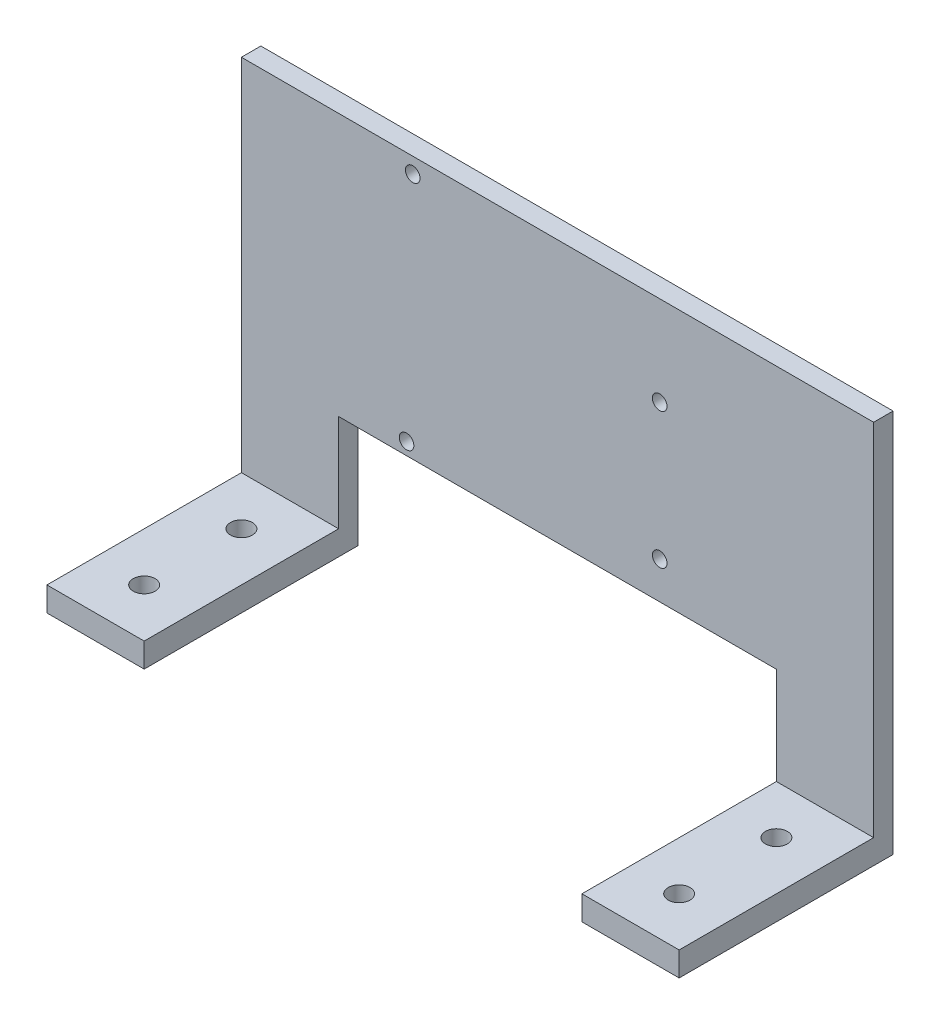
ISO-10303-21;
HEADER;
FILE_DESCRIPTION(('STEP AP214'),'2;1');
FILE_NAME('part.step','',(''),(''),'','','');
FILE_SCHEMA(('AUTOMOTIVE_DESIGN { 1 0 10303 214 1 1 1 1 }'));
ENDSEC;
DATA;
#1=APPLICATION_CONTEXT('core data for automotive mechanical design processes');
#2=APPLICATION_PROTOCOL_DEFINITION('international standard','automotive_design',2000,#1);
#3=PRODUCT_CONTEXT('',#1,'mechanical');
#4=PRODUCT('Part','Part','',(#3));
#5=PRODUCT_RELATED_PRODUCT_CATEGORY('part','',(#4));
#6=PRODUCT_DEFINITION_FORMATION('','',#4);
#7=PRODUCT_DEFINITION_CONTEXT('part definition',#1,'design');
#8=PRODUCT_DEFINITION('design','',#6,#7);
#9=PRODUCT_DEFINITION_SHAPE('','',#8);
#10=(LENGTH_UNIT() NAMED_UNIT(*) SI_UNIT(.MILLI.,.METRE.));
#11=(NAMED_UNIT(*) PLANE_ANGLE_UNIT() SI_UNIT($,.RADIAN.));
#12=(NAMED_UNIT(*) SI_UNIT($,.STERADIAN.) SOLID_ANGLE_UNIT());
#13=UNCERTAINTY_MEASURE_WITH_UNIT(LENGTH_MEASURE(1.E-05),#10,'distance_accuracy_value','');
#14=(GEOMETRIC_REPRESENTATION_CONTEXT(3) GLOBAL_UNCERTAINTY_ASSIGNED_CONTEXT((#13)) GLOBAL_UNIT_ASSIGNED_CONTEXT((#10,
#11,#12)) REPRESENTATION_CONTEXT('',''));
#15=CARTESIAN_POINT('',(0.,0.,0.));
#16=DIRECTION('',(0.,0.,1.));
#17=DIRECTION('',(1.,0.,0.));
#18=AXIS2_PLACEMENT_3D('',#15,#16,#17);
#19=CARTESIAN_POINT('',(0.,0.,0.));
#20=DIRECTION('',(0.,1.,0.));
#21=DIRECTION('',(0.,0.,1.));
#22=AXIS2_PLACEMENT_3D('',#19,#20,#21);
#23=PLANE('',#22);
#24=CARTESIAN_POINT('',(0.,0.,-20.));
#25=DIRECTION('',(0.,1.,0.));
#26=DIRECTION('',(0.,0.,1.));
#27=AXIS2_PLACEMENT_3D('',#24,#25,#26);
#28=CIRCLE('',#27,2.25);
#29=CARTESIAN_POINT('',(0.,0.,-17.75));
#30=VERTEX_POINT('',#29);
#31=EDGE_CURVE('E185',#30,#30,#28,.T.);
#32=ORIENTED_EDGE('',*,*,#31,.T.);
#33=EDGE_LOOP('',(#32));
#34=FACE_BOUND('',#33,.T.);
#35=CARTESIAN_POINT('',(0.,0.,0.));
#36=DIRECTION('',(0.,1.,0.));
#37=DIRECTION('',(0.,0.,1.));
#38=AXIS2_PLACEMENT_3D('',#35,#36,#37);
#39=CIRCLE('',#38,2.25);
#40=CARTESIAN_POINT('',(0.,0.,2.25));
#41=VERTEX_POINT('',#40);
#42=EDGE_CURVE('E179',#41,#41,#39,.T.);
#43=ORIENTED_EDGE('',*,*,#42,.T.);
#44=EDGE_LOOP('',(#43));
#45=FACE_BOUND('',#44,.T.);
#46=DIRECTION('',(-1.,0.,0.));
#47=VECTOR('',#46,1.);
#48=CARTESIAN_POINT('',(100.04,0.,-34.));
#49=LINE('',#48,#47);
#50=CARTESIAN_POINT('',(10.,0.,-34.));
#51=VERTEX_POINT('',#50);
#52=CARTESIAN_POINT('',(-10.,0.,-34.));
#53=VERTEX_POINT('',#52);
#54=EDGE_CURVE('E82',#51,#53,#49,.T.);
#55=ORIENTED_EDGE('',*,*,#54,.F.);
#56=DIRECTION('',(0.,0.,-1.));
#57=VECTOR('',#56,1.);
#58=CARTESIAN_POINT('',(10.,0.,-34.));
#59=LINE('',#58,#57);
#60=CARTESIAN_POINT('',(10.,0.,9.99999999999999));
#61=VERTEX_POINT('',#60);
#62=EDGE_CURVE('E164',#61,#51,#59,.T.);
#63=ORIENTED_EDGE('',*,*,#62,.F.);
#64=DIRECTION('',(1.,0.,0.));
#65=VECTOR('',#64,1.);
#66=CARTESIAN_POINT('',(-10.,0.,9.99999999999999));
#67=LINE('',#66,#65);
#68=CARTESIAN_POINT('',(-10.,0.,9.99999999999999));
#69=VERTEX_POINT('',#68);
#70=EDGE_CURVE('E168',#69,#61,#67,.T.);
#71=ORIENTED_EDGE('',*,*,#70,.F.);
#72=DIRECTION('',(0.,0.,1.));
#73=VECTOR('',#72,1.);
#74=CARTESIAN_POINT('',(-10.,0.,-34.));
#75=LINE('',#74,#73);
#76=EDGE_CURVE('E142',#53,#69,#75,.T.);
#77=ORIENTED_EDGE('',*,*,#76,.F.);
#78=EDGE_LOOP('',(#55,#63,#71,#77));
#79=FACE_BOUND('',#78,.T.);
#80=ADVANCED_FACE('F32',(#34,#45,#79),#23,.F.);
#81=CARTESIAN_POINT('',(0.,5.,0.));
#82=DIRECTION('',(0.,1.,0.));
#83=DIRECTION('',(0.,0.,1.));
#84=AXIS2_PLACEMENT_3D('',#81,#82,#83);
#85=PLANE('',#84);
#86=DIRECTION('',(1.,0.,0.));
#87=VECTOR('',#86,1.);
#88=CARTESIAN_POINT('',(0.,5.,-30.));
#89=LINE('',#88,#87);
#90=CARTESIAN_POINT('',(100.04,5.,-30.));
#91=VERTEX_POINT('',#90);
#92=CARTESIAN_POINT('',(120.04,5.,-30.));
#93=VERTEX_POINT('',#92);
#94=EDGE_CURVE('E133',#91,#93,#89,.T.);
#95=ORIENTED_EDGE('',*,*,#94,.F.);
#96=DIRECTION('',(0.,0.,1.));
#97=VECTOR('',#96,1.);
#98=CARTESIAN_POINT('',(100.04,5.,-34.));
#99=LINE('',#98,#97);
#100=CARTESIAN_POINT('',(100.04,5.,9.99999999999999));
#101=VERTEX_POINT('',#100);
#102=EDGE_CURVE('E102',#91,#101,#99,.T.);
#103=ORIENTED_EDGE('',*,*,#102,.T.);
#104=DIRECTION('',(1.,0.,0.));
#105=VECTOR('',#104,1.);
#106=CARTESIAN_POINT('',(100.04,5.,9.99999999999999));
#107=LINE('',#106,#105);
#108=CARTESIAN_POINT('',(120.04,5.,9.99999999999999));
#109=VERTEX_POINT('',#108);
#110=EDGE_CURVE('E54',#101,#109,#107,.T.);
#111=ORIENTED_EDGE('',*,*,#110,.T.);
#112=DIRECTION('',(0.,0.,-1.));
#113=VECTOR('',#112,1.);
#114=CARTESIAN_POINT('',(120.04,5.,-34.));
#115=LINE('',#114,#113);
#116=EDGE_CURVE('E48',#109,#93,#115,.T.);
#117=ORIENTED_EDGE('',*,*,#116,.T.);
#118=EDGE_LOOP('',(#95,#103,#111,#117));
#119=FACE_BOUND('',#118,.T.);
#120=CARTESIAN_POINT('',(110.04,5.,-20.));
#121=DIRECTION('',(0.,1.,0.));
#122=DIRECTION('',(0.,0.,1.));
#123=AXIS2_PLACEMENT_3D('',#120,#121,#122);
#124=CIRCLE('',#123,2.25);
#125=CARTESIAN_POINT('',(110.04,5.,-17.75));
#126=VERTEX_POINT('',#125);
#127=EDGE_CURVE('E119',#126,#126,#124,.T.);
#128=ORIENTED_EDGE('',*,*,#127,.F.);
#129=EDGE_LOOP('',(#128));
#130=FACE_BOUND('',#129,.T.);
#131=CARTESIAN_POINT('',(110.04,5.,0.));
#132=DIRECTION('',(0.,1.,0.));
#133=DIRECTION('',(0.,0.,1.));
#134=AXIS2_PLACEMENT_3D('',#131,#132,#133);
#135=CIRCLE('',#134,2.25);
#136=CARTESIAN_POINT('',(110.04,5.,2.25));
#137=VERTEX_POINT('',#136);
#138=EDGE_CURVE('E127',#137,#137,#135,.T.);
#139=ORIENTED_EDGE('',*,*,#138,.F.);
#140=EDGE_LOOP('',(#139));
#141=FACE_BOUND('',#140,.T.);
#142=ADVANCED_FACE('F311',(#119,#130,#141),#85,.T.);
#143=DIRECTION('',(0.,0.,1.));
#144=VECTOR('',#143,1.);
#145=CARTESIAN_POINT('',(100.04,0.,-34.));
#146=LINE('',#145,#144);
#147=CARTESIAN_POINT('',(100.04,0.,-34.));
#148=VERTEX_POINT('',#147);
#149=CARTESIAN_POINT('',(100.04,0.,9.99999999999999));
#150=VERTEX_POINT('',#149);
#151=EDGE_CURVE('E100',#148,#150,#146,.T.);
#152=ORIENTED_EDGE('',*,*,#151,.F.);
#153=CARTESIAN_POINT('',(120.04,0.,-34.));
#154=VERTEX_POINT('',#153);
#155=EDGE_CURVE('E92',#154,#148,#49,.T.);
#156=ORIENTED_EDGE('',*,*,#155,.F.);
#157=DIRECTION('',(0.,0.,-1.));
#158=VECTOR('',#157,1.);
#159=CARTESIAN_POINT('',(120.04,0.,-34.));
#160=LINE('',#159,#158);
#161=CARTESIAN_POINT('',(120.04,0.,9.99999999999999));
#162=VERTEX_POINT('',#161);
#163=EDGE_CURVE('E71',#162,#154,#160,.T.);
#164=ORIENTED_EDGE('',*,*,#163,.F.);
#165=DIRECTION('',(1.,0.,0.));
#166=VECTOR('',#165,1.);
#167=CARTESIAN_POINT('',(100.04,0.,9.99999999999999));
#168=LINE('',#167,#166);
#169=EDGE_CURVE('E83',#150,#162,#168,.T.);
#170=ORIENTED_EDGE('',*,*,#169,.F.);
#171=EDGE_LOOP('',(#152,#156,#164,#170));
#172=FACE_BOUND('',#171,.T.);
#173=CARTESIAN_POINT('',(110.04,0.,0.));
#174=DIRECTION('',(0.,1.,0.));
#175=DIRECTION('',(0.,0.,1.));
#176=AXIS2_PLACEMENT_3D('',#173,#174,#175);
#177=CIRCLE('',#176,2.25);
#178=CARTESIAN_POINT('',(110.04,0.,2.25));
#179=VERTEX_POINT('',#178);
#180=EDGE_CURVE('E130',#179,#179,#177,.T.);
#181=ORIENTED_EDGE('',*,*,#180,.T.);
#182=EDGE_LOOP('',(#181));
#183=FACE_BOUND('',#182,.T.);
#184=CARTESIAN_POINT('',(110.04,0.,-20.));
#185=DIRECTION('',(0.,1.,0.));
#186=DIRECTION('',(0.,0.,1.));
#187=AXIS2_PLACEMENT_3D('',#184,#185,#186);
#188=CIRCLE('',#187,2.25);
#189=CARTESIAN_POINT('',(110.04,0.,-17.75));
#190=VERTEX_POINT('',#189);
#191=EDGE_CURVE('E124',#190,#190,#188,.T.);
#192=ORIENTED_EDGE('',*,*,#191,.T.);
#193=EDGE_LOOP('',(#192));
#194=FACE_BOUND('',#193,.T.);
#195=ADVANCED_FACE('F98',(#172,#183,#194),#23,.F.);
#196=CARTESIAN_POINT('',(100.04,5.,-34.));
#197=DIRECTION('',(1.,0.,0.));
#198=DIRECTION('',(0.,0.,-1.));
#199=AXIS2_PLACEMENT_3D('',#196,#197,#198);
#200=PLANE('',#199);
#201=ORIENTED_EDGE('',*,*,#102,.F.);
#202=DIRECTION('',(0.,1.,0.));
#203=VECTOR('',#202,1.);
#204=CARTESIAN_POINT('',(100.04,0.,-30.));
#205=LINE('',#204,#203);
#206=CARTESIAN_POINT('',(100.04,25.,-30.));
#207=VERTEX_POINT('',#206);
#208=EDGE_CURVE('E205',#91,#207,#205,.T.);
#209=ORIENTED_EDGE('',*,*,#208,.T.);
#210=DIRECTION('',(0.,0.,1.));
#211=VECTOR('',#210,1.);
#212=CARTESIAN_POINT('',(100.04,25.,-35.));
#213=LINE('',#212,#211);
#214=CARTESIAN_POINT('',(100.04,25.,-34.));
#215=VERTEX_POINT('',#214);
#216=EDGE_CURVE('E197',#215,#207,#213,.T.);
#217=ORIENTED_EDGE('',*,*,#216,.F.);
#218=DIRECTION('',(0.,1.,0.));
#219=VECTOR('',#218,1.);
#220=CARTESIAN_POINT('',(100.04,5.,-34.));
#221=LINE('',#220,#219);
#222=EDGE_CURVE('E118',#148,#215,#221,.T.);
#223=ORIENTED_EDGE('',*,*,#222,.F.);
#224=ORIENTED_EDGE('',*,*,#151,.T.);
#225=DIRECTION('',(0.,-1.,0.));
#226=VECTOR('',#225,1.);
#227=CARTESIAN_POINT('',(100.04,5.,9.99999999999999));
#228=LINE('',#227,#226);
#229=EDGE_CURVE('E41',#101,#150,#228,.T.);
#230=ORIENTED_EDGE('',*,*,#229,.F.);
#231=EDGE_LOOP('',(#201,#209,#217,#223,#224,#230));
#232=FACE_BOUND('',#231,.T.);
#233=ADVANCED_FACE('F34',(#232),#200,.F.);
#234=CARTESIAN_POINT('',(100.04,5.,9.99999999999999));
#235=DIRECTION('',(0.,0.,-1.));
#236=DIRECTION('',(-1.,0.,0.));
#237=AXIS2_PLACEMENT_3D('',#234,#235,#236);
#238=PLANE('',#237);
#239=ORIENTED_EDGE('',*,*,#169,.T.);
#240=DIRECTION('',(0.,-1.,0.));
#241=VECTOR('',#240,1.);
#242=CARTESIAN_POINT('',(120.04,5.,9.99999999999999));
#243=LINE('',#242,#241);
#244=EDGE_CURVE('E78',#109,#162,#243,.T.);
#245=ORIENTED_EDGE('',*,*,#244,.F.);
#246=ORIENTED_EDGE('',*,*,#110,.F.);
#247=ORIENTED_EDGE('',*,*,#229,.T.);
#248=EDGE_LOOP('',(#239,#245,#246,#247));
#249=FACE_BOUND('',#248,.T.);
#250=ADVANCED_FACE('F112',(#249),#238,.F.);
#251=CARTESIAN_POINT('',(120.04,5.,-34.));
#252=DIRECTION('',(-1.,0.,0.));
#253=DIRECTION('',(0.,0.,1.));
#254=AXIS2_PLACEMENT_3D('',#251,#252,#253);
#255=PLANE('',#254);
#256=ORIENTED_EDGE('',*,*,#163,.T.);
#257=DIRECTION('',(0.,-1.,0.));
#258=VECTOR('',#257,1.);
#259=CARTESIAN_POINT('',(120.04,5.,-34.));
#260=LINE('',#259,#258);
#261=CARTESIAN_POINT('',(120.04,79.,-34.));
#262=VERTEX_POINT('',#261);
#263=EDGE_CURVE('E76',#262,#154,#260,.T.);
#264=ORIENTED_EDGE('',*,*,#263,.F.);
#265=DIRECTION('',(0.,0.,-1.));
#266=VECTOR('',#265,1.);
#267=CARTESIAN_POINT('',(120.04,79.,-34.));
#268=LINE('',#267,#266);
#269=CARTESIAN_POINT('',(120.04,79.,-30.));
#270=VERTEX_POINT('',#269);
#271=EDGE_CURVE('E149',#270,#262,#268,.T.);
#272=ORIENTED_EDGE('',*,*,#271,.F.);
#273=DIRECTION('',(0.,1.,0.));
#274=VECTOR('',#273,1.);
#275=CARTESIAN_POINT('',(120.04,0.,-30.));
#276=LINE('',#275,#274);
#277=EDGE_CURVE('E141',#93,#270,#276,.T.);
#278=ORIENTED_EDGE('',*,*,#277,.F.);
#279=ORIENTED_EDGE('',*,*,#116,.F.);
#280=ORIENTED_EDGE('',*,*,#244,.T.);
#281=EDGE_LOOP('',(#256,#264,#272,#278,#279,#280));
#282=FACE_BOUND('',#281,.T.);
#283=ADVANCED_FACE('F73',(#282),#255,.F.);
#284=CARTESIAN_POINT('',(100.04,5.,-34.));
#285=DIRECTION('',(0.,0.,1.));
#286=DIRECTION('',(1.,0.,0.));
#287=AXIS2_PLACEMENT_3D('',#284,#285,#286);
#288=PLANE('',#287);
#289=CARTESIAN_POINT('',(25.24,75.8,-34.));
#290=DIRECTION('',(0.,0.,1.));
#291=DIRECTION('',(1.,0.,0.));
#292=AXIS2_PLACEMENT_3D('',#289,#290,#291);
#293=CIRCLE('',#292,1.5);
#294=CARTESIAN_POINT('',(26.74,75.8,-34.));
#295=VERTEX_POINT('',#294);
#296=EDGE_CURVE('E225',#295,#295,#293,.T.);
#297=ORIENTED_EDGE('',*,*,#296,.T.);
#298=EDGE_LOOP('',(#297));
#299=FACE_BOUND('',#298,.T.);
#300=CARTESIAN_POINT('',(76.04,60.5599999999999,-34.));
#301=DIRECTION('',(0.,0.,1.));
#302=DIRECTION('',(1.,0.,0.));
#303=AXIS2_PLACEMENT_3D('',#300,#301,#302);
#304=CIRCLE('',#303,1.5);
#305=CARTESIAN_POINT('',(77.54,60.5599999999999,-34.));
#306=VERTEX_POINT('',#305);
#307=EDGE_CURVE('E219',#306,#306,#304,.T.);
#308=ORIENTED_EDGE('',*,*,#307,.T.);
#309=EDGE_LOOP('',(#308));
#310=FACE_BOUND('',#309,.T.);
#311=CARTESIAN_POINT('',(76.04,32.6199999999999,-34.));
#312=DIRECTION('',(0.,0.,1.));
#313=DIRECTION('',(1.,0.,0.));
#314=AXIS2_PLACEMENT_3D('',#311,#312,#313);
#315=CIRCLE('',#314,1.5);
#316=CARTESIAN_POINT('',(77.54,32.6199999999999,-34.));
#317=VERTEX_POINT('',#316);
#318=EDGE_CURVE('E213',#317,#317,#315,.T.);
#319=ORIENTED_EDGE('',*,*,#318,.T.);
#320=EDGE_LOOP('',(#319));
#321=FACE_BOUND('',#320,.T.);
#322=CARTESIAN_POINT('',(23.97,27.54,-34.));
#323=DIRECTION('',(0.,0.,1.));
#324=DIRECTION('',(1.,0.,0.));
#325=AXIS2_PLACEMENT_3D('',#322,#323,#324);
#326=CIRCLE('',#325,1.5);
#327=CARTESIAN_POINT('',(25.47,27.54,-34.));
#328=VERTEX_POINT('',#327);
#329=EDGE_CURVE('E36',#328,#328,#326,.T.);
#330=ORIENTED_EDGE('',*,*,#329,.T.);
#331=EDGE_LOOP('',(#330));
#332=FACE_BOUND('',#331,.T.);
#333=DIRECTION('',(-1.,0.,0.));
#334=VECTOR('',#333,1.);
#335=CARTESIAN_POINT('',(100.04,25.,-34.));
#336=LINE('',#335,#334);
#337=CARTESIAN_POINT('',(10.,25.,-34.));
#338=VERTEX_POINT('',#337);
#339=EDGE_CURVE('E193',#215,#338,#336,.T.);
#340=ORIENTED_EDGE('',*,*,#339,.T.);
#341=DIRECTION('',(0.,-1.,0.));
#342=VECTOR('',#341,1.);
#343=CARTESIAN_POINT('',(9.99999999999999,5.,-34.));
#344=LINE('',#343,#342);
#345=EDGE_CURVE('E188',#338,#51,#344,.T.);
#346=ORIENTED_EDGE('',*,*,#345,.T.);
#347=ORIENTED_EDGE('',*,*,#54,.T.);
#348=DIRECTION('',(0.,1.,0.));
#349=VECTOR('',#348,1.);
#350=CARTESIAN_POINT('',(-10.,0.,-34.));
#351=LINE('',#350,#349);
#352=CARTESIAN_POINT('',(-10.,79.,-34.));
#353=VERTEX_POINT('',#352);
#354=EDGE_CURVE('E137',#53,#353,#351,.T.);
#355=ORIENTED_EDGE('',*,*,#354,.T.);
#356=DIRECTION('',(-1.,0.,0.));
#357=VECTOR('',#356,1.);
#358=CARTESIAN_POINT('',(-10.,79.,-34.));
#359=LINE('',#358,#357);
#360=EDGE_CURVE('E95',#262,#353,#359,.T.);
#361=ORIENTED_EDGE('',*,*,#360,.F.);
#362=ORIENTED_EDGE('',*,*,#263,.T.);
#363=ORIENTED_EDGE('',*,*,#155,.T.);
#364=ORIENTED_EDGE('',*,*,#222,.T.);
#365=EDGE_LOOP('',(#340,#346,#347,#355,#361,#362,#363,#364));
#366=FACE_BOUND('',#365,.T.);
#367=ADVANCED_FACE('F89',(#299,#310,#321,#332,#366),#288,.F.);
#368=CARTESIAN_POINT('',(110.04,5.,-20.));
#369=DIRECTION('',(0.,-1.,0.));
#370=DIRECTION('',(0.,0.,-1.));
#371=AXIS2_PLACEMENT_3D('',#368,#369,#370);
#372=CYLINDRICAL_SURFACE('',#371,2.25);
#373=ORIENTED_EDGE('',*,*,#127,.T.);
#374=EDGE_LOOP('',(#373));
#375=FACE_BOUND('',#374,.T.);
#376=ORIENTED_EDGE('',*,*,#191,.F.);
#377=EDGE_LOOP('',(#376));
#378=FACE_BOUND('',#377,.T.);
#379=ADVANCED_FACE('F322',(#375,#378),#372,.F.);
#380=CARTESIAN_POINT('',(110.04,5.,0.));
#381=DIRECTION('',(0.,-1.,0.));
#382=DIRECTION('',(0.,0.,-1.));
#383=AXIS2_PLACEMENT_3D('',#380,#381,#382);
#384=CYLINDRICAL_SURFACE('',#383,2.25);
#385=ORIENTED_EDGE('',*,*,#138,.T.);
#386=EDGE_LOOP('',(#385));
#387=FACE_BOUND('',#386,.T.);
#388=ORIENTED_EDGE('',*,*,#180,.F.);
#389=EDGE_LOOP('',(#388));
#390=FACE_BOUND('',#389,.T.);
#391=ADVANCED_FACE('F319',(#387,#390),#384,.F.);
#392=CARTESIAN_POINT('',(-10.,0.,-34.));
#393=DIRECTION('',(-1.,0.,0.));
#394=DIRECTION('',(0.,0.,1.));
#395=AXIS2_PLACEMENT_3D('',#392,#393,#394);
#396=PLANE('',#395);
#397=DIRECTION('',(0.,0.,1.));
#398=VECTOR('',#397,1.);
#399=CARTESIAN_POINT('',(-10.,79.,-34.));
#400=LINE('',#399,#398);
#401=CARTESIAN_POINT('',(-10.,79.,-30.));
#402=VERTEX_POINT('',#401);
#403=EDGE_CURVE('E154',#353,#402,#400,.T.);
#404=ORIENTED_EDGE('',*,*,#403,.F.);
#405=ORIENTED_EDGE('',*,*,#354,.F.);
#406=ORIENTED_EDGE('',*,*,#76,.T.);
#407=DIRECTION('',(0.,-1.,0.));
#408=VECTOR('',#407,1.);
#409=CARTESIAN_POINT('',(-10.,5.,9.99999999999999));
#410=LINE('',#409,#408);
#411=CARTESIAN_POINT('',(-10.,5.,9.99999999999999));
#412=VERTEX_POINT('',#411);
#413=EDGE_CURVE('E157',#412,#69,#410,.T.);
#414=ORIENTED_EDGE('',*,*,#413,.F.);
#415=DIRECTION('',(0.,0.,1.));
#416=VECTOR('',#415,1.);
#417=CARTESIAN_POINT('',(-10.,5.,-34.));
#418=LINE('',#417,#416);
#419=CARTESIAN_POINT('',(-10.,5.,-30.));
#420=VERTEX_POINT('',#419);
#421=EDGE_CURVE('E167',#420,#412,#418,.T.);
#422=ORIENTED_EDGE('',*,*,#421,.F.);
#423=DIRECTION('',(0.,1.,0.));
#424=VECTOR('',#423,1.);
#425=CARTESIAN_POINT('',(-10.,0.,-30.));
#426=LINE('',#425,#424);
#427=EDGE_CURVE('E138',#420,#402,#426,.T.);
#428=ORIENTED_EDGE('',*,*,#427,.T.);
#429=EDGE_LOOP('',(#404,#405,#406,#414,#422,#428));
#430=FACE_BOUND('',#429,.T.);
#431=ADVANCED_FACE('F239',(#430),#396,.T.);
#432=CARTESIAN_POINT('',(-10.,0.,-30.));
#433=DIRECTION('',(0.,0.,1.));
#434=DIRECTION('',(1.,0.,0.));
#435=AXIS2_PLACEMENT_3D('',#432,#433,#434);
#436=PLANE('',#435);
#437=CARTESIAN_POINT('',(25.24,75.8,-30.));
#438=DIRECTION('',(0.,0.,1.));
#439=DIRECTION('',(1.,0.,0.));
#440=AXIS2_PLACEMENT_3D('',#437,#438,#439);
#441=CIRCLE('',#440,1.5);
#442=CARTESIAN_POINT('',(26.74,75.8,-30.));
#443=VERTEX_POINT('',#442);
#444=EDGE_CURVE('E228',#443,#443,#441,.T.);
#445=ORIENTED_EDGE('',*,*,#444,.F.);
#446=EDGE_LOOP('',(#445));
#447=FACE_BOUND('',#446,.T.);
#448=CARTESIAN_POINT('',(76.04,60.5599999999999,-30.));
#449=DIRECTION('',(0.,0.,1.));
#450=DIRECTION('',(1.,0.,0.));
#451=AXIS2_PLACEMENT_3D('',#448,#449,#450);
#452=CIRCLE('',#451,1.5);
#453=CARTESIAN_POINT('',(77.54,60.5599999999999,-30.));
#454=VERTEX_POINT('',#453);
#455=EDGE_CURVE('E222',#454,#454,#452,.T.);
#456=ORIENTED_EDGE('',*,*,#455,.F.);
#457=EDGE_LOOP('',(#456));
#458=FACE_BOUND('',#457,.T.);
#459=CARTESIAN_POINT('',(76.04,32.6199999999999,-30.));
#460=DIRECTION('',(0.,0.,1.));
#461=DIRECTION('',(1.,0.,0.));
#462=AXIS2_PLACEMENT_3D('',#459,#460,#461);
#463=CIRCLE('',#462,1.5);
#464=CARTESIAN_POINT('',(77.54,32.6199999999999,-30.));
#465=VERTEX_POINT('',#464);
#466=EDGE_CURVE('E216',#465,#465,#463,.T.);
#467=ORIENTED_EDGE('',*,*,#466,.F.);
#468=EDGE_LOOP('',(#467));
#469=FACE_BOUND('',#468,.T.);
#470=CARTESIAN_POINT('',(23.97,27.54,-30.));
#471=DIRECTION('',(0.,0.,1.));
#472=DIRECTION('',(1.,0.,0.));
#473=AXIS2_PLACEMENT_3D('',#470,#471,#472);
#474=CIRCLE('',#473,1.5);
#475=CARTESIAN_POINT('',(25.47,27.54,-30.));
#476=VERTEX_POINT('',#475);
#477=EDGE_CURVE('E210',#476,#476,#474,.T.);
#478=ORIENTED_EDGE('',*,*,#477,.F.);
#479=EDGE_LOOP('',(#478));
#480=FACE_BOUND('',#479,.T.);
#481=DIRECTION('',(0.,-1.,0.));
#482=VECTOR('',#481,1.);
#483=CARTESIAN_POINT('',(10.,0.,-30.));
#484=LINE('',#483,#482);
#485=CARTESIAN_POINT('',(10.,25.,-30.));
#486=VERTEX_POINT('',#485);
#487=CARTESIAN_POINT('',(10.,5.,-30.));
#488=VERTEX_POINT('',#487);
#489=EDGE_CURVE('E207',#486,#488,#484,.T.);
#490=ORIENTED_EDGE('',*,*,#489,.F.);
#491=DIRECTION('',(-1.,0.,0.));
#492=VECTOR('',#491,1.);
#493=CARTESIAN_POINT('',(10.,25.,-30.));
#494=LINE('',#493,#492);
#495=EDGE_CURVE('E200',#207,#486,#494,.T.);
#496=ORIENTED_EDGE('',*,*,#495,.F.);
#497=ORIENTED_EDGE('',*,*,#208,.F.);
#498=ORIENTED_EDGE('',*,*,#94,.T.);
#499=ORIENTED_EDGE('',*,*,#277,.T.);
#500=DIRECTION('',(1.,0.,0.));
#501=VECTOR('',#500,1.);
#502=CARTESIAN_POINT('',(-10.,79.,-30.));
#503=LINE('',#502,#501);
#504=EDGE_CURVE('E151',#402,#270,#503,.T.);
#505=ORIENTED_EDGE('',*,*,#504,.F.);
#506=ORIENTED_EDGE('',*,*,#427,.F.);
#507=DIRECTION('',(-1.,0.,0.));
#508=VECTOR('',#507,1.);
#509=CARTESIAN_POINT('',(-10.,5.,-30.));
#510=LINE('',#509,#508);
#511=EDGE_CURVE('E11',#488,#420,#510,.T.);
#512=ORIENTED_EDGE('',*,*,#511,.F.);
#513=EDGE_LOOP('',(#490,#496,#497,#498,#499,#505,#506,#512));
#514=FACE_BOUND('',#513,.T.);
#515=ADVANCED_FACE('F235',(#447,#458,#469,#480,#514),#436,.T.);
#516=CARTESIAN_POINT('',(0.,79.,0.));
#517=DIRECTION('',(0.,1.,0.));
#518=DIRECTION('',(0.,0.,1.));
#519=AXIS2_PLACEMENT_3D('',#516,#517,#518);
#520=PLANE('',#519);
#521=ORIENTED_EDGE('',*,*,#403,.T.);
#522=ORIENTED_EDGE('',*,*,#504,.T.);
#523=ORIENTED_EDGE('',*,*,#271,.T.);
#524=ORIENTED_EDGE('',*,*,#360,.T.);
#525=EDGE_LOOP('',(#521,#522,#523,#524));
#526=FACE_BOUND('',#525,.T.);
#527=ADVANCED_FACE('F238',(#526),#520,.T.);
#528=CARTESIAN_POINT('',(0.,5.,0.));
#529=DIRECTION('',(0.,1.,0.));
#530=DIRECTION('',(0.,0.,1.));
#531=AXIS2_PLACEMENT_3D('',#528,#529,#530);
#532=PLANE('',#531);
#533=CARTESIAN_POINT('',(0.,5.,0.));
#534=DIRECTION('',(0.,1.,0.));
#535=DIRECTION('',(0.,0.,1.));
#536=AXIS2_PLACEMENT_3D('',#533,#534,#535);
#537=CIRCLE('',#536,2.25);
#538=CARTESIAN_POINT('',(0.,5.,2.25));
#539=VERTEX_POINT('',#538);
#540=EDGE_CURVE('E171',#539,#539,#537,.T.);
#541=ORIENTED_EDGE('',*,*,#540,.F.);
#542=EDGE_LOOP('',(#541));
#543=FACE_BOUND('',#542,.T.);
#544=DIRECTION('',(0.,0.,-1.));
#545=VECTOR('',#544,1.);
#546=CARTESIAN_POINT('',(10.,5.,-34.));
#547=LINE('',#546,#545);
#548=CARTESIAN_POINT('',(10.,5.,9.99999999999999));
#549=VERTEX_POINT('',#548);
#550=EDGE_CURVE('E163',#549,#488,#547,.T.);
#551=ORIENTED_EDGE('',*,*,#550,.T.);
#552=ORIENTED_EDGE('',*,*,#511,.T.);
#553=ORIENTED_EDGE('',*,*,#421,.T.);
#554=DIRECTION('',(1.,0.,0.));
#555=VECTOR('',#554,1.);
#556=CARTESIAN_POINT('',(-10.,5.,9.99999999999999));
#557=LINE('',#556,#555);
#558=EDGE_CURVE('E174',#412,#549,#557,.T.);
#559=ORIENTED_EDGE('',*,*,#558,.T.);
#560=EDGE_LOOP('',(#551,#552,#553,#559));
#561=FACE_BOUND('',#560,.T.);
#562=CARTESIAN_POINT('',(0.,5.,-20.));
#563=DIRECTION('',(0.,1.,0.));
#564=DIRECTION('',(0.,0.,1.));
#565=AXIS2_PLACEMENT_3D('',#562,#563,#564);
#566=CIRCLE('',#565,2.25);
#567=CARTESIAN_POINT('',(0.,5.,-17.75));
#568=VERTEX_POINT('',#567);
#569=EDGE_CURVE('E182',#568,#568,#566,.T.);
#570=ORIENTED_EDGE('',*,*,#569,.F.);
#571=EDGE_LOOP('',(#570));
#572=FACE_BOUND('',#571,.T.);
#573=ADVANCED_FACE('F265',(#543,#561,#572),#532,.T.);
#574=CARTESIAN_POINT('',(-10.,5.,9.99999999999999));
#575=DIRECTION('',(0.,0.,-1.));
#576=DIRECTION('',(-1.,0.,0.));
#577=AXIS2_PLACEMENT_3D('',#574,#575,#576);
#578=PLANE('',#577);
#579=ORIENTED_EDGE('',*,*,#70,.T.);
#580=DIRECTION('',(0.,-1.,0.));
#581=VECTOR('',#580,1.);
#582=CARTESIAN_POINT('',(10.,5.,9.99999999999999));
#583=LINE('',#582,#581);
#584=EDGE_CURVE('E160',#549,#61,#583,.T.);
#585=ORIENTED_EDGE('',*,*,#584,.F.);
#586=ORIENTED_EDGE('',*,*,#558,.F.);
#587=ORIENTED_EDGE('',*,*,#413,.T.);
#588=EDGE_LOOP('',(#579,#585,#586,#587));
#589=FACE_BOUND('',#588,.T.);
#590=ADVANCED_FACE('F274',(#589),#578,.F.);
#591=CARTESIAN_POINT('',(10.,5.,-34.));
#592=DIRECTION('',(-1.,0.,0.));
#593=DIRECTION('',(0.,0.,1.));
#594=AXIS2_PLACEMENT_3D('',#591,#592,#593);
#595=PLANE('',#594);
#596=ORIENTED_EDGE('',*,*,#62,.T.);
#597=ORIENTED_EDGE('',*,*,#345,.F.);
#598=DIRECTION('',(0.,0.,1.));
#599=VECTOR('',#598,1.);
#600=CARTESIAN_POINT('',(10.,25.,-35.));
#601=LINE('',#600,#599);
#602=EDGE_CURVE('E196',#338,#486,#601,.T.);
#603=ORIENTED_EDGE('',*,*,#602,.T.);
#604=ORIENTED_EDGE('',*,*,#489,.T.);
#605=ORIENTED_EDGE('',*,*,#550,.F.);
#606=ORIENTED_EDGE('',*,*,#584,.T.);
#607=EDGE_LOOP('',(#596,#597,#603,#604,#605,#606));
#608=FACE_BOUND('',#607,.T.);
#609=ADVANCED_FACE('F258',(#608),#595,.F.);
#610=CARTESIAN_POINT('',(0.,5.,0.));
#611=DIRECTION('',(0.,-1.,0.));
#612=DIRECTION('',(0.,0.,-1.));
#613=AXIS2_PLACEMENT_3D('',#610,#611,#612);
#614=CYLINDRICAL_SURFACE('',#613,2.25);
#615=ORIENTED_EDGE('',*,*,#540,.T.);
#616=EDGE_LOOP('',(#615));
#617=FACE_BOUND('',#616,.T.);
#618=ORIENTED_EDGE('',*,*,#42,.F.);
#619=EDGE_LOOP('',(#618));
#620=FACE_BOUND('',#619,.T.);
#621=ADVANCED_FACE('F377',(#617,#620),#614,.F.);
#622=CARTESIAN_POINT('',(0.,5.,-20.));
#623=DIRECTION('',(0.,-1.,0.));
#624=DIRECTION('',(0.,0.,-1.));
#625=AXIS2_PLACEMENT_3D('',#622,#623,#624);
#626=CYLINDRICAL_SURFACE('',#625,2.25);
#627=ORIENTED_EDGE('',*,*,#569,.T.);
#628=EDGE_LOOP('',(#627));
#629=FACE_BOUND('',#628,.T.);
#630=ORIENTED_EDGE('',*,*,#31,.F.);
#631=EDGE_LOOP('',(#630));
#632=FACE_BOUND('',#631,.T.);
#633=ADVANCED_FACE('F372',(#629,#632),#626,.F.);
#634=CARTESIAN_POINT('',(10.,25.,-35.));
#635=DIRECTION('',(0.,1.,0.));
#636=DIRECTION('',(0.,0.,1.));
#637=AXIS2_PLACEMENT_3D('',#634,#635,#636);
#638=PLANE('',#637);
#639=ORIENTED_EDGE('',*,*,#216,.T.);
#640=ORIENTED_EDGE('',*,*,#495,.T.);
#641=ORIENTED_EDGE('',*,*,#602,.F.);
#642=ORIENTED_EDGE('',*,*,#339,.F.);
#643=EDGE_LOOP('',(#639,#640,#641,#642));
#644=FACE_BOUND('',#643,.T.);
#645=ADVANCED_FACE('F309',(#644),#638,.F.);
#646=CARTESIAN_POINT('',(23.97,27.54,-30.));
#647=DIRECTION('',(0.,0.,1.));
#648=DIRECTION('',(1.,0.,0.));
#649=AXIS2_PLACEMENT_3D('',#646,#647,#648);
#650=CYLINDRICAL_SURFACE('',#649,1.5);
#651=ORIENTED_EDGE('',*,*,#477,.T.);
#652=EDGE_LOOP('',(#651));
#653=FACE_BOUND('',#652,.T.);
#654=ORIENTED_EDGE('',*,*,#329,.F.);
#655=EDGE_LOOP('',(#654));
#656=FACE_BOUND('',#655,.T.);
#657=ADVANCED_FACE('F466',(#653,#656),#650,.F.);
#658=CARTESIAN_POINT('',(76.04,32.6199999999999,-30.));
#659=DIRECTION('',(0.,0.,1.));
#660=DIRECTION('',(1.,0.,0.));
#661=AXIS2_PLACEMENT_3D('',#658,#659,#660);
#662=CYLINDRICAL_SURFACE('',#661,1.5);
#663=ORIENTED_EDGE('',*,*,#466,.T.);
#664=EDGE_LOOP('',(#663));
#665=FACE_BOUND('',#664,.T.);
#666=ORIENTED_EDGE('',*,*,#318,.F.);
#667=EDGE_LOOP('',(#666));
#668=FACE_BOUND('',#667,.T.);
#669=ADVANCED_FACE('F471',(#665,#668),#662,.F.);
#670=CARTESIAN_POINT('',(76.04,60.5599999999999,-30.));
#671=DIRECTION('',(0.,0.,1.));
#672=DIRECTION('',(1.,0.,0.));
#673=AXIS2_PLACEMENT_3D('',#670,#671,#672);
#674=CYLINDRICAL_SURFACE('',#673,1.5);
#675=ORIENTED_EDGE('',*,*,#455,.T.);
#676=EDGE_LOOP('',(#675));
#677=FACE_BOUND('',#676,.T.);
#678=ORIENTED_EDGE('',*,*,#307,.F.);
#679=EDGE_LOOP('',(#678));
#680=FACE_BOUND('',#679,.T.);
#681=ADVANCED_FACE('F481',(#677,#680),#674,.F.);
#682=CARTESIAN_POINT('',(25.24,75.8,-30.));
#683=DIRECTION('',(0.,0.,1.));
#684=DIRECTION('',(1.,0.,0.));
#685=AXIS2_PLACEMENT_3D('',#682,#683,#684);
#686=CYLINDRICAL_SURFACE('',#685,1.5);
#687=ORIENTED_EDGE('',*,*,#444,.T.);
#688=EDGE_LOOP('',(#687));
#689=FACE_BOUND('',#688,.T.);
#690=ORIENTED_EDGE('',*,*,#296,.F.);
#691=EDGE_LOOP('',(#690));
#692=FACE_BOUND('',#691,.T.);
#693=ADVANCED_FACE('F232',(#689,#692),#686,.F.);
#694=CLOSED_SHELL('',(#80,#142,#195,#233,#250,#283,#367,#379,#391,#431,#515,#527,#573,#590,#609,
#621,#633,#645,#657,#669,#681,#693));
#695=MANIFOLD_SOLID_BREP('B2',#694);
#696=ADVANCED_BREP_SHAPE_REPRESENTATION('',(#18,#695),#14);
#697=SHAPE_DEFINITION_REPRESENTATION(#9,#696);
ENDSEC;
END-ISO-10303-21;
